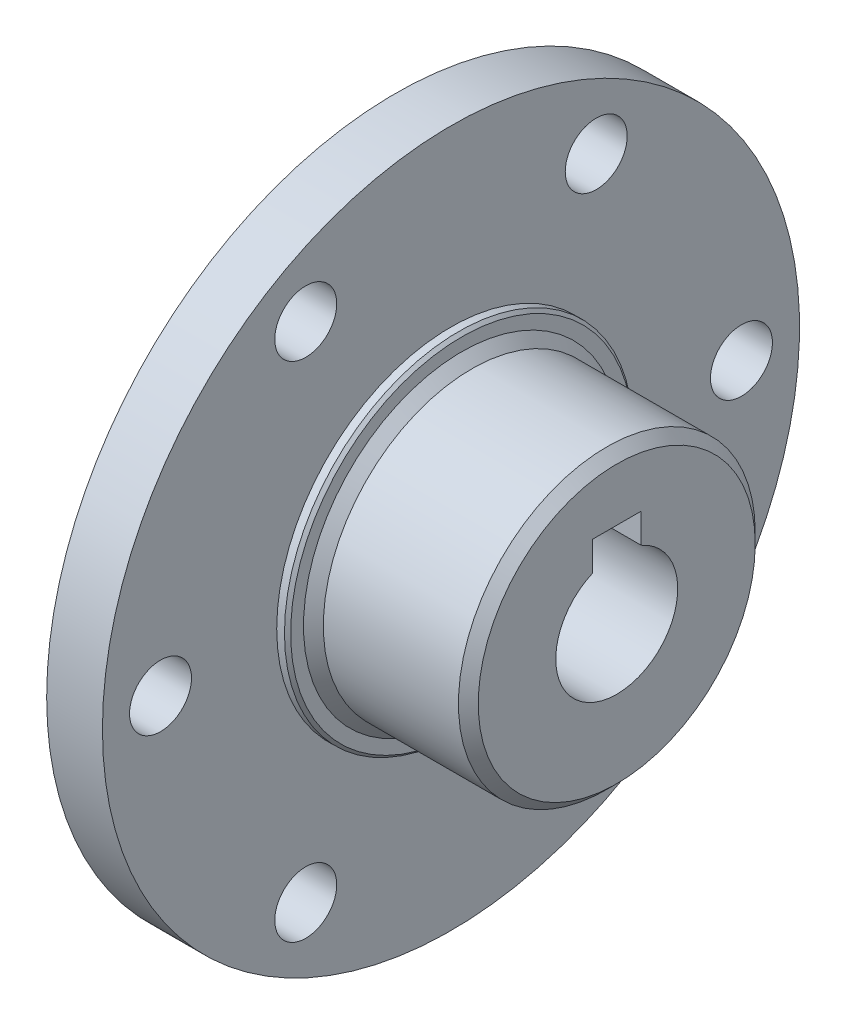
ISO-10303-21;
HEADER;
FILE_DESCRIPTION(('STEP AP214'),'2;1');
FILE_NAME('part.step','',(''),(''),'','','');
FILE_SCHEMA(('AUTOMOTIVE_DESIGN { 1 0 10303 214 1 1 1 1 }'));
ENDSEC;
DATA;
#1=APPLICATION_CONTEXT('core data for automotive mechanical design processes');
#2=APPLICATION_PROTOCOL_DEFINITION('international standard','automotive_design',2000,#1);
#3=PRODUCT_CONTEXT('',#1,'mechanical');
#4=PRODUCT('Part','Part','',(#3));
#5=PRODUCT_RELATED_PRODUCT_CATEGORY('part','',(#4));
#6=PRODUCT_DEFINITION_FORMATION('','',#4);
#7=PRODUCT_DEFINITION_CONTEXT('part definition',#1,'design');
#8=PRODUCT_DEFINITION('design','',#6,#7);
#9=PRODUCT_DEFINITION_SHAPE('','',#8);
#10=(LENGTH_UNIT() NAMED_UNIT(*) SI_UNIT(.MILLI.,.METRE.));
#11=(NAMED_UNIT(*) PLANE_ANGLE_UNIT() SI_UNIT($,.RADIAN.));
#12=(NAMED_UNIT(*) SI_UNIT($,.STERADIAN.) SOLID_ANGLE_UNIT());
#13=UNCERTAINTY_MEASURE_WITH_UNIT(LENGTH_MEASURE(1.E-05),#10,'distance_accuracy_value','');
#14=(GEOMETRIC_REPRESENTATION_CONTEXT(3) GLOBAL_UNCERTAINTY_ASSIGNED_CONTEXT((#13)) GLOBAL_UNIT_ASSIGNED_CONTEXT((#10,
#11,#12)) REPRESENTATION_CONTEXT('',''));
#15=CARTESIAN_POINT('',(0.,0.,0.));
#16=DIRECTION('',(0.,0.,1.));
#17=DIRECTION('',(1.,0.,0.));
#18=AXIS2_PLACEMENT_3D('',#15,#16,#17);
#19=CARTESIAN_POINT('',(-13.0350662460568,0.,0.));
#20=DIRECTION('',(-1.,0.,0.));
#21=DIRECTION('',(0.,0.,1.));
#22=AXIS2_PLACEMENT_3D('',#19,#20,#21);
#23=CYLINDRICAL_SURFACE('',#22,28.575);
#24=CARTESIAN_POINT('',(-13.0350662460568,0.,0.));
#25=DIRECTION('',(-1.,0.,0.));
#26=DIRECTION('',(0.,0.,1.));
#27=AXIS2_PLACEMENT_3D('',#24,#25,#26);
#28=CIRCLE('',#27,28.575);
#29=CARTESIAN_POINT('',(-13.0350662460568,0.,28.575));
#30=VERTEX_POINT('',#29);
#31=EDGE_CURVE('E115',#30,#30,#28,.T.);
#32=ORIENTED_EDGE('',*,*,#31,.T.);
#33=EDGE_LOOP('',(#32));
#34=FACE_BOUND('',#33,.T.);
#35=CARTESIAN_POINT('',(-17.6070662460568,0.,0.));
#36=DIRECTION('',(-1.,0.,0.));
#37=DIRECTION('',(0.,0.,1.));
#38=AXIS2_PLACEMENT_3D('',#35,#36,#37);
#39=CIRCLE('',#38,28.575);
#40=CARTESIAN_POINT('',(-17.6070662460568,0.,28.575));
#41=VERTEX_POINT('',#40);
#42=EDGE_CURVE('E79',#41,#41,#39,.T.);
#43=ORIENTED_EDGE('',*,*,#42,.F.);
#44=EDGE_LOOP('',(#43));
#45=FACE_BOUND('',#44,.T.);
#46=ADVANCED_FACE('F32',(#34,#45),#23,.T.);
#47=CARTESIAN_POINT('',(-13.0350662460568,28.575,0.));
#48=DIRECTION('',(1.,0.,0.));
#49=DIRECTION('',(0.,0.,-1.));
#50=AXIS2_PLACEMENT_3D('',#47,#48,#49);
#51=PLANE('',#50);
#52=CARTESIAN_POINT('',(-13.0350662460568,20.6222299276169,11.90625));
#53=DIRECTION('',(1.,0.,0.));
#54=DIRECTION('',(0.,0.,-1.));
#55=AXIS2_PLACEMENT_3D('',#52,#53,#54);
#56=CIRCLE('',#55,2.54);
#57=CARTESIAN_POINT('',(-13.0350662460568,20.6222299276169,9.36625));
#58=VERTEX_POINT('',#57);
#59=EDGE_CURVE('E200',#58,#58,#56,.T.);
#60=ORIENTED_EDGE('',*,*,#59,.F.);
#61=EDGE_LOOP('',(#60));
#62=FACE_BOUND('',#61,.T.);
#63=CARTESIAN_POINT('',(-13.0350662460568,20.6222299276169,-11.90625));
#64=DIRECTION('',(1.,0.,0.));
#65=DIRECTION('',(0.,0.,-1.));
#66=AXIS2_PLACEMENT_3D('',#63,#64,#65);
#67=CIRCLE('',#66,2.54);
#68=CARTESIAN_POINT('',(-13.0350662460568,20.6222299276169,-14.44625));
#69=VERTEX_POINT('',#68);
#70=EDGE_CURVE('E120',#69,#69,#67,.T.);
#71=ORIENTED_EDGE('',*,*,#70,.F.);
#72=EDGE_LOOP('',(#71));
#73=FACE_BOUND('',#72,.T.);
#74=CARTESIAN_POINT('',(-13.0350662460568,0.,-23.8125));
#75=DIRECTION('',(1.,0.,0.));
#76=DIRECTION('',(0.,0.,-1.));
#77=AXIS2_PLACEMENT_3D('',#74,#75,#76);
#78=CIRCLE('',#77,2.54);
#79=CARTESIAN_POINT('',(-13.0350662460568,0.,-26.3525));
#80=VERTEX_POINT('',#79);
#81=EDGE_CURVE('E193',#80,#80,#78,.T.);
#82=ORIENTED_EDGE('',*,*,#81,.F.);
#83=EDGE_LOOP('',(#82));
#84=FACE_BOUND('',#83,.T.);
#85=CARTESIAN_POINT('',(-13.0350662460568,-20.6222299276169,-11.90625));
#86=DIRECTION('',(1.,0.,0.));
#87=DIRECTION('',(0.,0.,-1.));
#88=AXIS2_PLACEMENT_3D('',#85,#86,#87);
#89=CIRCLE('',#88,2.54);
#90=CARTESIAN_POINT('',(-13.0350662460568,-20.6222299276169,-14.44625));
#91=VERTEX_POINT('',#90);
#92=EDGE_CURVE('E187',#91,#91,#89,.T.);
#93=ORIENTED_EDGE('',*,*,#92,.F.);
#94=EDGE_LOOP('',(#93));
#95=FACE_BOUND('',#94,.T.);
#96=CARTESIAN_POINT('',(-13.0350662460568,-20.622229927617,11.90625));
#97=DIRECTION('',(1.,0.,0.));
#98=DIRECTION('',(0.,0.,-1.));
#99=AXIS2_PLACEMENT_3D('',#96,#97,#98);
#100=CIRCLE('',#99,2.54);
#101=CARTESIAN_POINT('',(-13.0350662460568,-20.622229927617,9.36624999999995));
#102=VERTEX_POINT('',#101);
#103=EDGE_CURVE('E181',#102,#102,#100,.T.);
#104=ORIENTED_EDGE('',*,*,#103,.F.);
#105=EDGE_LOOP('',(#104));
#106=FACE_BOUND('',#105,.T.);
#107=CARTESIAN_POINT('',(-13.0350662460568,0.,23.8125));
#108=DIRECTION('',(1.,0.,0.));
#109=DIRECTION('',(0.,0.,-1.));
#110=AXIS2_PLACEMENT_3D('',#107,#108,#109);
#111=CIRCLE('',#110,2.54);
#112=CARTESIAN_POINT('',(-13.0350662460568,0.,21.2725));
#113=VERTEX_POINT('',#112);
#114=EDGE_CURVE('E90',#113,#113,#111,.T.);
#115=ORIENTED_EDGE('',*,*,#114,.F.);
#116=EDGE_LOOP('',(#115));
#117=FACE_BOUND('',#116,.T.);
#118=CARTESIAN_POINT('',(-13.0350662460568,0.,0.));
#119=DIRECTION('',(1.,0.,0.));
#120=DIRECTION('',(0.,0.,-1.));
#121=AXIS2_PLACEMENT_3D('',#118,#119,#120);
#122=CIRCLE('',#121,14.2875);
#123=CARTESIAN_POINT('',(-13.0350662460568,0.,-14.2875));
#124=VERTEX_POINT('',#123);
#125=EDGE_CURVE('E112',#124,#124,#122,.T.);
#126=ORIENTED_EDGE('',*,*,#125,.F.);
#127=EDGE_LOOP('',(#126));
#128=FACE_BOUND('',#127,.T.);
#129=ORIENTED_EDGE('',*,*,#31,.F.);
#130=EDGE_LOOP('',(#129));
#131=FACE_BOUND('',#130,.T.);
#132=ADVANCED_FACE('F213',(#62,#73,#84,#95,#106,#117,#128,#131),#51,.T.);
#133=CARTESIAN_POINT('',(-17.6070662460568,0.,0.));
#134=DIRECTION('',(-1.,0.,0.));
#135=DIRECTION('',(0.,0.,1.));
#136=AXIS2_PLACEMENT_3D('',#133,#134,#135);
#137=PLANE('',#136);
#138=CARTESIAN_POINT('',(-17.6070662460568,20.6222299276169,11.90625));
#139=DIRECTION('',(-1.,0.,0.));
#140=DIRECTION('',(0.,0.,1.));
#141=AXIS2_PLACEMENT_3D('',#138,#139,#140);
#142=CIRCLE('',#141,2.54);
#143=CARTESIAN_POINT('',(-17.6070662460568,20.6222299276169,14.44625));
#144=VERTEX_POINT('',#143);
#145=EDGE_CURVE('E203',#144,#144,#142,.T.);
#146=ORIENTED_EDGE('',*,*,#145,.F.);
#147=EDGE_LOOP('',(#146));
#148=FACE_BOUND('',#147,.T.);
#149=CARTESIAN_POINT('',(-17.6070662460568,20.6222299276169,-11.90625));
#150=DIRECTION('',(-1.,0.,0.));
#151=DIRECTION('',(0.,0.,1.));
#152=AXIS2_PLACEMENT_3D('',#149,#150,#151);
#153=CIRCLE('',#152,2.54);
#154=CARTESIAN_POINT('',(-17.6070662460568,20.6222299276169,-9.36624999999998));
#155=VERTEX_POINT('',#154);
#156=EDGE_CURVE('E124',#155,#155,#153,.T.);
#157=ORIENTED_EDGE('',*,*,#156,.F.);
#158=EDGE_LOOP('',(#157));
#159=FACE_BOUND('',#158,.T.);
#160=CARTESIAN_POINT('',(-17.6070662460568,0.,-23.8125));
#161=DIRECTION('',(-1.,0.,0.));
#162=DIRECTION('',(0.,0.,1.));
#163=AXIS2_PLACEMENT_3D('',#160,#161,#162);
#164=CIRCLE('',#163,2.54);
#165=CARTESIAN_POINT('',(-17.6070662460568,0.,-21.2725));
#166=VERTEX_POINT('',#165);
#167=EDGE_CURVE('E123',#166,#166,#164,.T.);
#168=ORIENTED_EDGE('',*,*,#167,.F.);
#169=EDGE_LOOP('',(#168));
#170=FACE_BOUND('',#169,.T.);
#171=CARTESIAN_POINT('',(-17.6070662460568,-20.6222299276169,-11.90625));
#172=DIRECTION('',(-1.,0.,0.));
#173=DIRECTION('',(0.,0.,1.));
#174=AXIS2_PLACEMENT_3D('',#171,#172,#173);
#175=CIRCLE('',#174,2.54);
#176=CARTESIAN_POINT('',(-17.6070662460568,-20.6222299276169,-9.36625000000004));
#177=VERTEX_POINT('',#176);
#178=EDGE_CURVE('E190',#177,#177,#175,.T.);
#179=ORIENTED_EDGE('',*,*,#178,.F.);
#180=EDGE_LOOP('',(#179));
#181=FACE_BOUND('',#180,.T.);
#182=CARTESIAN_POINT('',(-17.6070662460568,-20.622229927617,11.90625));
#183=DIRECTION('',(-1.,0.,0.));
#184=DIRECTION('',(0.,0.,1.));
#185=AXIS2_PLACEMENT_3D('',#182,#183,#184);
#186=CIRCLE('',#185,2.54);
#187=CARTESIAN_POINT('',(-17.6070662460568,-20.622229927617,14.44625));
#188=VERTEX_POINT('',#187);
#189=EDGE_CURVE('E184',#188,#188,#186,.T.);
#190=ORIENTED_EDGE('',*,*,#189,.F.);
#191=EDGE_LOOP('',(#190));
#192=FACE_BOUND('',#191,.T.);
#193=CARTESIAN_POINT('',(-17.6070662460568,0.,23.8125));
#194=DIRECTION('',(-1.,0.,0.));
#195=DIRECTION('',(0.,0.,1.));
#196=AXIS2_PLACEMENT_3D('',#193,#194,#195);
#197=CIRCLE('',#196,2.54);
#198=CARTESIAN_POINT('',(-17.6070662460568,0.,26.3525));
#199=VERTEX_POINT('',#198);
#200=EDGE_CURVE('E178',#199,#199,#197,.T.);
#201=ORIENTED_EDGE('',*,*,#200,.F.);
#202=EDGE_LOOP('',(#201));
#203=FACE_BOUND('',#202,.T.);
#204=CARTESIAN_POINT('',(-17.6070662460568,0.,0.));
#205=DIRECTION('',(-1.,0.,0.));
#206=DIRECTION('',(0.,0.,1.));
#207=AXIS2_PLACEMENT_3D('',#204,#205,#206);
#208=CIRCLE('',#207,14.2875);
#209=CARTESIAN_POINT('',(-17.6070662460568,0.,14.2875));
#210=VERTEX_POINT('',#209);
#211=EDGE_CURVE('E108',#210,#210,#208,.T.);
#212=ORIENTED_EDGE('',*,*,#211,.F.);
#213=EDGE_LOOP('',(#212));
#214=FACE_BOUND('',#213,.T.);
#215=ORIENTED_EDGE('',*,*,#42,.T.);
#216=EDGE_LOOP('',(#215));
#217=FACE_BOUND('',#216,.T.);
#218=ADVANCED_FACE('F209',(#148,#159,#170,#181,#192,#203,#214,#217),#137,.T.);
#219=CARTESIAN_POINT('',(-12.1460662460568,0.,0.));
#220=DIRECTION('',(-1.,0.,0.));
#221=DIRECTION('',(0.,0.,1.));
#222=AXIS2_PLACEMENT_3D('',#219,#220,#221);
#223=CYLINDRICAL_SURFACE('',#222,14.2875);
#224=CARTESIAN_POINT('',(-12.4000662460568,0.,0.));
#225=DIRECTION('',(1.,0.,0.));
#226=DIRECTION('',(0.,0.,-1.));
#227=AXIS2_PLACEMENT_3D('',#224,#225,#226);
#228=CIRCLE('',#227,14.2875);
#229=CARTESIAN_POINT('',(-12.4000662460568,0.,-14.2875));
#230=VERTEX_POINT('',#229);
#231=EDGE_CURVE('E127',#230,#230,#228,.F.);
#232=ORIENTED_EDGE('',*,*,#231,.T.);
#233=EDGE_LOOP('',(#232));
#234=FACE_BOUND('',#233,.T.);
#235=ORIENTED_EDGE('',*,*,#125,.T.);
#236=EDGE_LOOP('',(#235));
#237=FACE_BOUND('',#236,.T.);
#238=ADVANCED_FACE('F212',(#234,#237),#223,.T.);
#239=CARTESIAN_POINT('',(-12.1460662460568,0.,0.));
#240=DIRECTION('',(1.,0.,0.));
#241=DIRECTION('',(0.,0.,-1.));
#242=AXIS2_PLACEMENT_3D('',#239,#240,#241);
#243=PLANE('',#242);
#244=CARTESIAN_POINT('',(-12.1460662460568,0.,0.));
#245=DIRECTION('',(1.,0.,0.));
#246=DIRECTION('',(0.,0.,-1.));
#247=AXIS2_PLACEMENT_3D('',#244,#245,#246);
#248=CIRCLE('',#247,12.9794);
#249=CARTESIAN_POINT('',(-12.1460662460568,0.,-12.9794));
#250=VERTEX_POINT('',#249);
#251=EDGE_CURVE('E40',#250,#250,#248,.F.);
#252=ORIENTED_EDGE('',*,*,#251,.T.);
#253=EDGE_LOOP('',(#252));
#254=FACE_BOUND('',#253,.T.);
#255=CARTESIAN_POINT('',(-12.1460662460568,0.,0.));
#256=DIRECTION('',(1.,0.,0.));
#257=DIRECTION('',(0.,0.,-1.));
#258=AXIS2_PLACEMENT_3D('',#255,#256,#257);
#259=CIRCLE('',#258,14.0335);
#260=CARTESIAN_POINT('',(-12.1460662460568,0.,-14.0335));
#261=VERTEX_POINT('',#260);
#262=EDGE_CURVE('E111',#261,#261,#259,.T.);
#263=ORIENTED_EDGE('',*,*,#262,.T.);
#264=EDGE_LOOP('',(#263));
#265=FACE_BOUND('',#264,.T.);
#266=ADVANCED_FACE('F144',(#254,#265),#243,.T.);
#267=CARTESIAN_POINT('',(0.553933753943227,0.,0.));
#268=DIRECTION('',(-1.,0.,0.));
#269=DIRECTION('',(0.,0.,1.));
#270=AXIS2_PLACEMENT_3D('',#267,#268,#269);
#271=CYLINDRICAL_SURFACE('',#270,12.1666);
#272=CARTESIAN_POINT('',(-11.3332662460568,0.,0.));
#273=DIRECTION('',(1.,0.,0.));
#274=DIRECTION('',(0.,0.,-1.));
#275=AXIS2_PLACEMENT_3D('',#272,#273,#274);
#276=CIRCLE('',#275,12.1666);
#277=CARTESIAN_POINT('',(-11.3332662460568,0.,-12.1666));
#278=VERTEX_POINT('',#277);
#279=EDGE_CURVE('E139',#278,#278,#276,.T.);
#280=ORIENTED_EDGE('',*,*,#279,.T.);
#281=EDGE_LOOP('',(#280));
#282=FACE_BOUND('',#281,.T.);
#283=CARTESIAN_POINT('',(-0.258866246056769,0.,0.));
#284=DIRECTION('',(1.,0.,0.));
#285=DIRECTION('',(0.,0.,-1.));
#286=AXIS2_PLACEMENT_3D('',#283,#284,#285);
#287=CIRCLE('',#286,12.1666);
#288=CARTESIAN_POINT('',(-0.258866246056769,0.,-12.1666));
#289=VERTEX_POINT('',#288);
#290=EDGE_CURVE('E136',#289,#289,#287,.F.);
#291=ORIENTED_EDGE('',*,*,#290,.T.);
#292=EDGE_LOOP('',(#291));
#293=FACE_BOUND('',#292,.T.);
#294=ADVANCED_FACE('F153',(#282,#293),#271,.T.);
#295=CARTESIAN_POINT('',(0.553933753943227,0.,0.));
#296=DIRECTION('',(1.,0.,0.));
#297=DIRECTION('',(0.,0.,-1.));
#298=AXIS2_PLACEMENT_3D('',#295,#296,#297);
#299=PLANE('',#298);
#300=CARTESIAN_POINT('',(0.553933753943227,0.,0.));
#301=DIRECTION('',(1.,0.,0.));
#302=DIRECTION('',(0.,0.,-1.));
#303=AXIS2_PLACEMENT_3D('',#300,#301,#302);
#304=CIRCLE('',#303,11.3538);
#305=CARTESIAN_POINT('',(0.553933753943227,0.,-11.3538));
#306=VERTEX_POINT('',#305);
#307=EDGE_CURVE('E11',#306,#306,#304,.T.);
#308=ORIENTED_EDGE('',*,*,#307,.T.);
#309=EDGE_LOOP('',(#308));
#310=FACE_BOUND('',#309,.T.);
#311=CARTESIAN_POINT('',(0.553933753943227,0.,0.));
#312=DIRECTION('',(-1.,0.,0.));
#313=DIRECTION('',(0.,0.,1.));
#314=AXIS2_PLACEMENT_3D('',#311,#312,#313);
#315=CIRCLE('',#314,5.);
#316=CARTESIAN_POINT('',(0.553933753943227,4.58257569495584,-2.));
#317=VERTEX_POINT('',#316);
#318=CARTESIAN_POINT('',(0.553933753943227,4.58257569495584,2.));
#319=VERTEX_POINT('',#318);
#320=EDGE_CURVE('E74',#317,#319,#315,.T.);
#321=ORIENTED_EDGE('',*,*,#320,.T.);
#322=DIRECTION('',(0.,1.,0.));
#323=VECTOR('',#322,1.);
#324=CARTESIAN_POINT('',(0.553933753943227,4.58257569495584,2.));
#325=LINE('',#324,#323);
#326=CARTESIAN_POINT('',(0.553933753943227,7.,2.));
#327=VERTEX_POINT('',#326);
#328=EDGE_CURVE('E94',#319,#327,#325,.T.);
#329=ORIENTED_EDGE('',*,*,#328,.T.);
#330=DIRECTION('',(0.,0.,-1.));
#331=VECTOR('',#330,1.);
#332=CARTESIAN_POINT('',(0.553933753943227,7.,2.));
#333=LINE('',#332,#331);
#334=CARTESIAN_POINT('',(0.553933753943227,7.,-2.));
#335=VERTEX_POINT('',#334);
#336=EDGE_CURVE('E47',#327,#335,#333,.T.);
#337=ORIENTED_EDGE('',*,*,#336,.T.);
#338=DIRECTION('',(0.,-1.,0.));
#339=VECTOR('',#338,1.);
#340=CARTESIAN_POINT('',(0.553933753943227,7.,-2.));
#341=LINE('',#340,#339);
#342=EDGE_CURVE('E107',#335,#317,#341,.T.);
#343=ORIENTED_EDGE('',*,*,#342,.T.);
#344=EDGE_LOOP('',(#321,#329,#337,#343));
#345=FACE_BOUND('',#344,.T.);
#346=ADVANCED_FACE('F156',(#310,#345),#299,.T.);
#347=CARTESIAN_POINT('',(-18.4960662460568,0.,0.));
#348=DIRECTION('',(1.,0.,0.));
#349=DIRECTION('',(0.,0.,-1.));
#350=AXIS2_PLACEMENT_3D('',#347,#348,#349);
#351=CYLINDRICAL_SURFACE('',#350,14.2875);
#352=CARTESIAN_POINT('',(-18.2420662460568,0.,0.));
#353=DIRECTION('',(-1.,0.,0.));
#354=DIRECTION('',(0.,0.,1.));
#355=AXIS2_PLACEMENT_3D('',#352,#353,#354);
#356=CIRCLE('',#355,14.2875);
#357=CARTESIAN_POINT('',(-18.2420662460568,0.,14.2875));
#358=VERTEX_POINT('',#357);
#359=EDGE_CURVE('E133',#358,#358,#356,.F.);
#360=ORIENTED_EDGE('',*,*,#359,.T.);
#361=EDGE_LOOP('',(#360));
#362=FACE_BOUND('',#361,.T.);
#363=ORIENTED_EDGE('',*,*,#211,.T.);
#364=EDGE_LOOP('',(#363));
#365=FACE_BOUND('',#364,.T.);
#366=ADVANCED_FACE('F166',(#362,#365),#351,.T.);
#367=CARTESIAN_POINT('',(-18.4960662460568,0.,0.));
#368=DIRECTION('',(-1.,0.,0.));
#369=DIRECTION('',(0.,0.,1.));
#370=AXIS2_PLACEMENT_3D('',#367,#368,#369);
#371=PLANE('',#370);
#372=CARTESIAN_POINT('',(-18.4960662460568,0.,0.));
#373=DIRECTION('',(-1.,0.,0.));
#374=DIRECTION('',(0.,0.,1.));
#375=AXIS2_PLACEMENT_3D('',#372,#373,#374);
#376=CIRCLE('',#375,14.0335);
#377=CARTESIAN_POINT('',(-18.4960662460568,0.,14.0335));
#378=VERTEX_POINT('',#377);
#379=EDGE_CURVE('E130',#378,#378,#376,.T.);
#380=ORIENTED_EDGE('',*,*,#379,.T.);
#381=EDGE_LOOP('',(#380));
#382=FACE_BOUND('',#381,.T.);
#383=CARTESIAN_POINT('',(-18.4960662460568,0.,0.));
#384=DIRECTION('',(-1.,0.,0.));
#385=DIRECTION('',(0.,0.,1.));
#386=AXIS2_PLACEMENT_3D('',#383,#384,#385);
#387=CIRCLE('',#386,5.);
#388=CARTESIAN_POINT('',(-18.4960662460568,4.58257569495584,-2.));
#389=VERTEX_POINT('',#388);
#390=CARTESIAN_POINT('',(-18.4960662460568,4.58257569495584,2.));
#391=VERTEX_POINT('',#390);
#392=EDGE_CURVE('E55',#389,#391,#387,.T.);
#393=ORIENTED_EDGE('',*,*,#392,.F.);
#394=DIRECTION('',(0.,-1.,0.));
#395=VECTOR('',#394,1.);
#396=CARTESIAN_POINT('',(-18.4960662460568,7.,-2.));
#397=LINE('',#396,#395);
#398=CARTESIAN_POINT('',(-18.4960662460568,7.,-2.));
#399=VERTEX_POINT('',#398);
#400=EDGE_CURVE('E87',#399,#389,#397,.T.);
#401=ORIENTED_EDGE('',*,*,#400,.F.);
#402=DIRECTION('',(0.,0.,-1.));
#403=VECTOR('',#402,1.);
#404=CARTESIAN_POINT('',(-18.4960662460568,7.,2.));
#405=LINE('',#404,#403);
#406=CARTESIAN_POINT('',(-18.4960662460568,7.,2.));
#407=VERTEX_POINT('',#406);
#408=EDGE_CURVE('E95',#407,#399,#405,.T.);
#409=ORIENTED_EDGE('',*,*,#408,.F.);
#410=DIRECTION('',(0.,1.,0.));
#411=VECTOR('',#410,1.);
#412=CARTESIAN_POINT('',(-18.4960662460568,4.58257569495584,2.));
#413=LINE('',#412,#411);
#414=EDGE_CURVE('E89',#391,#407,#413,.T.);
#415=ORIENTED_EDGE('',*,*,#414,.F.);
#416=EDGE_LOOP('',(#393,#401,#409,#415));
#417=FACE_BOUND('',#416,.T.);
#418=ADVANCED_FACE('F85',(#382,#417),#371,.T.);
#419=CARTESIAN_POINT('',(0.553933753943227,7.,-2.));
#420=DIRECTION('',(0.,0.,-1.));
#421=DIRECTION('',(-1.,0.,0.));
#422=AXIS2_PLACEMENT_3D('',#419,#420,#421);
#423=PLANE('',#422);
#424=ORIENTED_EDGE('',*,*,#400,.T.);
#425=DIRECTION('',(-1.,0.,0.));
#426=VECTOR('',#425,1.);
#427=CARTESIAN_POINT('',(0.553933753943227,4.58257569495584,-2.));
#428=LINE('',#427,#426);
#429=EDGE_CURVE('E71',#317,#389,#428,.T.);
#430=ORIENTED_EDGE('',*,*,#429,.F.);
#431=ORIENTED_EDGE('',*,*,#342,.F.);
#432=DIRECTION('',(-1.,0.,0.));
#433=VECTOR('',#432,1.);
#434=CARTESIAN_POINT('',(0.553933753943227,7.,-2.));
#435=LINE('',#434,#433);
#436=EDGE_CURVE('E80',#335,#399,#435,.T.);
#437=ORIENTED_EDGE('',*,*,#436,.T.);
#438=EDGE_LOOP('',(#424,#430,#431,#437));
#439=FACE_BOUND('',#438,.T.);
#440=ADVANCED_FACE('F92',(#439),#423,.F.);
#441=CARTESIAN_POINT('',(0.553933753943227,7.,2.));
#442=DIRECTION('',(0.,1.,0.));
#443=DIRECTION('',(0.,0.,1.));
#444=AXIS2_PLACEMENT_3D('',#441,#442,#443);
#445=PLANE('',#444);
#446=ORIENTED_EDGE('',*,*,#408,.T.);
#447=ORIENTED_EDGE('',*,*,#436,.F.);
#448=ORIENTED_EDGE('',*,*,#336,.F.);
#449=DIRECTION('',(-1.,0.,0.));
#450=VECTOR('',#449,1.);
#451=CARTESIAN_POINT('',(0.553933753943227,7.,2.));
#452=LINE('',#451,#450);
#453=EDGE_CURVE('E103',#327,#407,#452,.T.);
#454=ORIENTED_EDGE('',*,*,#453,.T.);
#455=EDGE_LOOP('',(#446,#447,#448,#454));
#456=FACE_BOUND('',#455,.T.);
#457=ADVANCED_FACE('F172',(#456),#445,.F.);
#458=CARTESIAN_POINT('',(0.553933753943227,4.58257569495584,2.));
#459=DIRECTION('',(0.,0.,1.));
#460=DIRECTION('',(0.,-1.,0.));
#461=AXIS2_PLACEMENT_3D('',#458,#459,#460);
#462=PLANE('',#461);
#463=ORIENTED_EDGE('',*,*,#414,.T.);
#464=ORIENTED_EDGE('',*,*,#453,.F.);
#465=ORIENTED_EDGE('',*,*,#328,.F.);
#466=DIRECTION('',(-1.,0.,0.));
#467=VECTOR('',#466,1.);
#468=CARTESIAN_POINT('',(0.553933753943227,4.58257569495584,2.));
#469=LINE('',#468,#467);
#470=EDGE_CURVE('E105',#319,#391,#469,.T.);
#471=ORIENTED_EDGE('',*,*,#470,.T.);
#472=EDGE_LOOP('',(#463,#464,#465,#471));
#473=FACE_BOUND('',#472,.T.);
#474=ADVANCED_FACE('F171',(#473),#462,.F.);
#475=CARTESIAN_POINT('',(0.553933753943227,0.,0.));
#476=DIRECTION('',(-1.,0.,0.));
#477=DIRECTION('',(0.,0.,1.));
#478=AXIS2_PLACEMENT_3D('',#475,#476,#477);
#479=CYLINDRICAL_SURFACE('',#478,5.);
#480=ORIENTED_EDGE('',*,*,#392,.T.);
#481=ORIENTED_EDGE('',*,*,#470,.F.);
#482=ORIENTED_EDGE('',*,*,#320,.F.);
#483=ORIENTED_EDGE('',*,*,#429,.T.);
#484=EDGE_LOOP('',(#480,#481,#482,#483));
#485=FACE_BOUND('',#484,.T.);
#486=ADVANCED_FACE('F72',(#485),#479,.F.);
#487=CARTESIAN_POINT('',(-17.6070662460568,0.,23.8125));
#488=DIRECTION('',(-1.,0.,0.));
#489=DIRECTION('',(0.,0.,1.));
#490=AXIS2_PLACEMENT_3D('',#487,#488,#489);
#491=CYLINDRICAL_SURFACE('',#490,2.54);
#492=ORIENTED_EDGE('',*,*,#114,.T.);
#493=EDGE_LOOP('',(#492));
#494=FACE_BOUND('',#493,.T.);
#495=ORIENTED_EDGE('',*,*,#200,.T.);
#496=EDGE_LOOP('',(#495));
#497=FACE_BOUND('',#496,.T.);
#498=ADVANCED_FACE('F361',(#494,#497),#491,.F.);
#499=CARTESIAN_POINT('',(-17.6070662460568,-20.622229927617,11.90625));
#500=DIRECTION('',(-1.,0.,0.));
#501=DIRECTION('',(0.,0.,1.));
#502=AXIS2_PLACEMENT_3D('',#499,#500,#501);
#503=CYLINDRICAL_SURFACE('',#502,2.54);
#504=ORIENTED_EDGE('',*,*,#103,.T.);
#505=EDGE_LOOP('',(#504));
#506=FACE_BOUND('',#505,.T.);
#507=ORIENTED_EDGE('',*,*,#189,.T.);
#508=EDGE_LOOP('',(#507));
#509=FACE_BOUND('',#508,.T.);
#510=ADVANCED_FACE('F353',(#506,#509),#503,.F.);
#511=CARTESIAN_POINT('',(-17.6070662460568,-20.6222299276169,-11.90625));
#512=DIRECTION('',(-1.,0.,0.));
#513=DIRECTION('',(0.,0.,1.));
#514=AXIS2_PLACEMENT_3D('',#511,#512,#513);
#515=CYLINDRICAL_SURFACE('',#514,2.54);
#516=ORIENTED_EDGE('',*,*,#92,.T.);
#517=EDGE_LOOP('',(#516));
#518=FACE_BOUND('',#517,.T.);
#519=ORIENTED_EDGE('',*,*,#178,.T.);
#520=EDGE_LOOP('',(#519));
#521=FACE_BOUND('',#520,.T.);
#522=ADVANCED_FACE('F345',(#518,#521),#515,.F.);
#523=CARTESIAN_POINT('',(-17.6070662460568,0.,-23.8125));
#524=DIRECTION('',(-1.,0.,0.));
#525=DIRECTION('',(0.,0.,1.));
#526=AXIS2_PLACEMENT_3D('',#523,#524,#525);
#527=CYLINDRICAL_SURFACE('',#526,2.54);
#528=ORIENTED_EDGE('',*,*,#81,.T.);
#529=EDGE_LOOP('',(#528));
#530=FACE_BOUND('',#529,.T.);
#531=ORIENTED_EDGE('',*,*,#167,.T.);
#532=EDGE_LOOP('',(#531));
#533=FACE_BOUND('',#532,.T.);
#534=ADVANCED_FACE('F337',(#530,#533),#527,.F.);
#535=CARTESIAN_POINT('',(-17.6070662460568,20.6222299276169,-11.90625));
#536=DIRECTION('',(-1.,0.,0.));
#537=DIRECTION('',(0.,0.,1.));
#538=AXIS2_PLACEMENT_3D('',#535,#536,#537);
#539=CYLINDRICAL_SURFACE('',#538,2.54);
#540=ORIENTED_EDGE('',*,*,#70,.T.);
#541=EDGE_LOOP('',(#540));
#542=FACE_BOUND('',#541,.T.);
#543=ORIENTED_EDGE('',*,*,#156,.T.);
#544=EDGE_LOOP('',(#543));
#545=FACE_BOUND('',#544,.T.);
#546=ADVANCED_FACE('F330',(#542,#545),#539,.F.);
#547=CARTESIAN_POINT('',(-17.6070662460568,20.6222299276169,11.90625));
#548=DIRECTION('',(-1.,0.,0.));
#549=DIRECTION('',(0.,0.,1.));
#550=AXIS2_PLACEMENT_3D('',#547,#548,#549);
#551=CYLINDRICAL_SURFACE('',#550,2.54);
#552=ORIENTED_EDGE('',*,*,#59,.T.);
#553=EDGE_LOOP('',(#552));
#554=FACE_BOUND('',#553,.T.);
#555=ORIENTED_EDGE('',*,*,#145,.T.);
#556=EDGE_LOOP('',(#555));
#557=FACE_BOUND('',#556,.T.);
#558=ADVANCED_FACE('F207',(#554,#557),#551,.F.);
#559=CARTESIAN_POINT('',(-12.1460662460568,0.,0.));
#560=DIRECTION('',(-1.,0.,0.));
#561=DIRECTION('',(0.,0.,1.));
#562=AXIS2_PLACEMENT_3D('',#559,#560,#561);
#563=CONICAL_SURFACE('',#562,14.0335,0.785398163397452);
#564=ORIENTED_EDGE('',*,*,#231,.F.);
#565=EDGE_LOOP('',(#564));
#566=FACE_BOUND('',#565,.T.);
#567=ORIENTED_EDGE('',*,*,#262,.F.);
#568=EDGE_LOOP('',(#567));
#569=FACE_BOUND('',#568,.T.);
#570=ADVANCED_FACE('F238',(#566,#569),#563,.T.);
#571=CARTESIAN_POINT('',(-18.4960662460568,0.,0.));
#572=DIRECTION('',(1.,0.,0.));
#573=DIRECTION('',(0.,0.,-1.));
#574=AXIS2_PLACEMENT_3D('',#571,#572,#573);
#575=CONICAL_SURFACE('',#574,14.0335,0.785398163397448);
#576=ORIENTED_EDGE('',*,*,#359,.F.);
#577=EDGE_LOOP('',(#576));
#578=FACE_BOUND('',#577,.T.);
#579=ORIENTED_EDGE('',*,*,#379,.F.);
#580=EDGE_LOOP('',(#579));
#581=FACE_BOUND('',#580,.T.);
#582=ADVANCED_FACE('F150',(#578,#581),#575,.T.);
#583=CARTESIAN_POINT('',(-11.3332662460568,0.,0.));
#584=DIRECTION('',(-1.,0.,0.));
#585=DIRECTION('',(0.,0.,1.));
#586=AXIS2_PLACEMENT_3D('',#583,#584,#585);
#587=CONICAL_SURFACE('',#586,12.1666,0.785398163397437);
#588=ORIENTED_EDGE('',*,*,#251,.F.);
#589=EDGE_LOOP('',(#588));
#590=FACE_BOUND('',#589,.T.);
#591=ORIENTED_EDGE('',*,*,#279,.F.);
#592=EDGE_LOOP('',(#591));
#593=FACE_BOUND('',#592,.T.);
#594=ADVANCED_FACE('F147',(#590,#593),#587,.T.);
#595=CARTESIAN_POINT('',(0.553933753943227,0.,0.));
#596=DIRECTION('',(-1.,0.,0.));
#597=DIRECTION('',(0.,0.,1.));
#598=AXIS2_PLACEMENT_3D('',#595,#596,#597);
#599=CONICAL_SURFACE('',#598,11.3538,0.785398163397446);
#600=ORIENTED_EDGE('',*,*,#290,.F.);
#601=EDGE_LOOP('',(#600));
#602=FACE_BOUND('',#601,.T.);
#603=ORIENTED_EDGE('',*,*,#307,.F.);
#604=EDGE_LOOP('',(#603));
#605=FACE_BOUND('',#604,.T.);
#606=ADVANCED_FACE('F34',(#602,#605),#599,.T.);
#607=CLOSED_SHELL('',(#46,#132,#218,#238,#266,#294,#346,#366,#418,#440,#457,#474,#486,#498,#510,
#522,#534,#546,#558,#570,#582,#594,#606));
#608=MANIFOLD_SOLID_BREP('B2',#607);
#609=ADVANCED_BREP_SHAPE_REPRESENTATION('',(#18,#608),#14);
#610=SHAPE_DEFINITION_REPRESENTATION(#9,#609);
ENDSEC;
END-ISO-10303-21;
